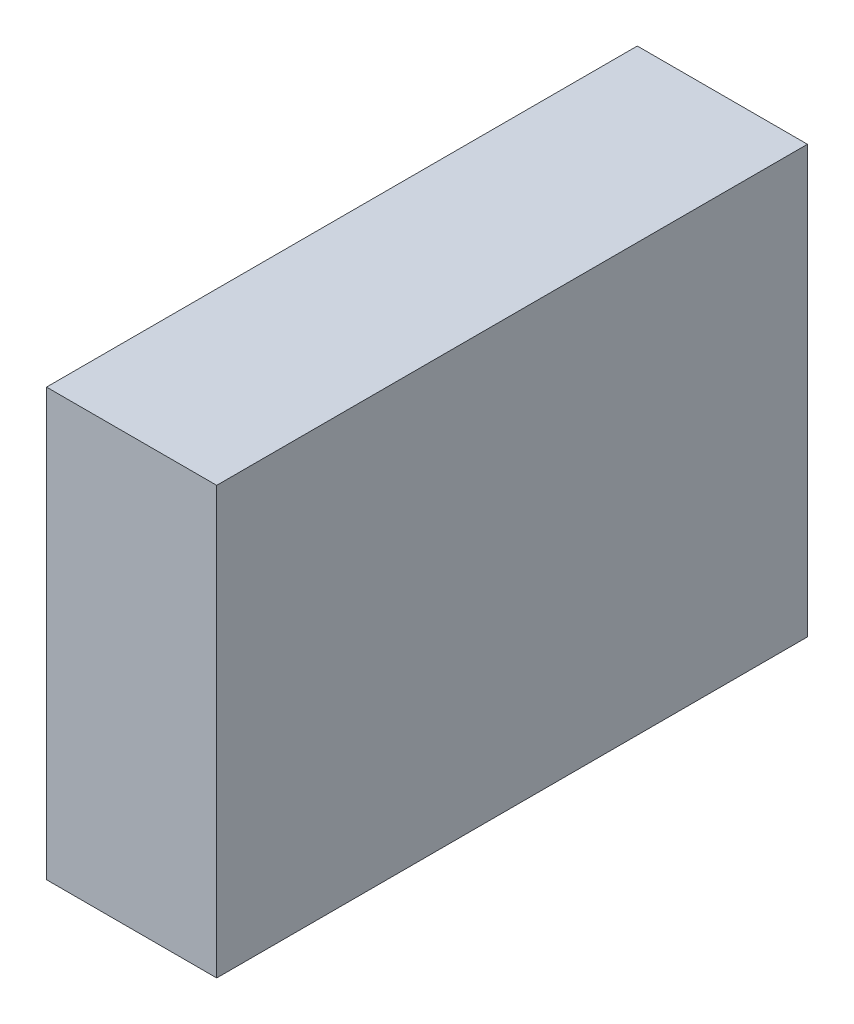
ISO-10303-21;
HEADER;
FILE_DESCRIPTION(('STEP AP214'),'2;1');
FILE_NAME('part.step','',(''),(''),'','','');
FILE_SCHEMA(('AUTOMOTIVE_DESIGN { 1 0 10303 214 1 1 1 1 }'));
ENDSEC;
DATA;
#1=APPLICATION_CONTEXT('core data for automotive mechanical design processes');
#2=APPLICATION_PROTOCOL_DEFINITION('international standard','automotive_design',2000,#1);
#3=PRODUCT_CONTEXT('',#1,'mechanical');
#4=PRODUCT('Part','Part','',(#3));
#5=PRODUCT_RELATED_PRODUCT_CATEGORY('part','',(#4));
#6=PRODUCT_DEFINITION_FORMATION('','',#4);
#7=PRODUCT_DEFINITION_CONTEXT('part definition',#1,'design');
#8=PRODUCT_DEFINITION('design','',#6,#7);
#9=PRODUCT_DEFINITION_SHAPE('','',#8);
#10=(LENGTH_UNIT() NAMED_UNIT(*) SI_UNIT(.MILLI.,.METRE.));
#11=(NAMED_UNIT(*) PLANE_ANGLE_UNIT() SI_UNIT($,.RADIAN.));
#12=(NAMED_UNIT(*) SI_UNIT($,.STERADIAN.) SOLID_ANGLE_UNIT());
#13=UNCERTAINTY_MEASURE_WITH_UNIT(LENGTH_MEASURE(1.E-05),#10,'distance_accuracy_value','');
#14=(GEOMETRIC_REPRESENTATION_CONTEXT(3) GLOBAL_UNCERTAINTY_ASSIGNED_CONTEXT((#13)) GLOBAL_UNIT_ASSIGNED_CONTEXT((#10,
#11,#12)) REPRESENTATION_CONTEXT('',''));
#15=CARTESIAN_POINT('',(0.,0.,0.));
#16=DIRECTION('',(0.,0.,1.));
#17=DIRECTION('',(1.,0.,0.));
#18=AXIS2_PLACEMENT_3D('',#15,#16,#17);
#19=CARTESIAN_POINT('',(0.,0.,914.4));
#20=DIRECTION('',(1.,0.,0.));
#21=DIRECTION('',(0.,0.,-1.));
#22=AXIS2_PLACEMENT_3D('',#19,#20,#21);
#23=PLANE('',#22);
#24=DIRECTION('',(0.,-1.,0.));
#25=VECTOR('',#24,1.);
#26=CARTESIAN_POINT('',(0.,0.,0.));
#27=LINE('',#26,#25);
#28=CARTESIAN_POINT('',(0.,660.4,0.));
#29=VERTEX_POINT('',#28);
#30=CARTESIAN_POINT('',(0.,0.,0.));
#31=VERTEX_POINT('',#30);
#32=EDGE_CURVE('E113',#29,#31,#27,.T.);
#33=ORIENTED_EDGE('',*,*,#32,.T.);
#34=DIRECTION('',(0.,0.,-1.));
#35=VECTOR('',#34,1.);
#36=CARTESIAN_POINT('',(0.,0.,914.4));
#37=LINE('',#36,#35);
#38=CARTESIAN_POINT('',(0.,0.,914.4));
#39=VERTEX_POINT('',#38);
#40=EDGE_CURVE('E11',#39,#31,#37,.T.);
#41=ORIENTED_EDGE('',*,*,#40,.F.);
#42=DIRECTION('',(0.,-1.,0.));
#43=VECTOR('',#42,1.);
#44=CARTESIAN_POINT('',(0.,0.,914.4));
#45=LINE('',#44,#43);
#46=CARTESIAN_POINT('',(0.,660.4,914.4));
#47=VERTEX_POINT('',#46);
#48=EDGE_CURVE('E97',#47,#39,#45,.T.);
#49=ORIENTED_EDGE('',*,*,#48,.F.);
#50=DIRECTION('',(0.,0.,-1.));
#51=VECTOR('',#50,1.);
#52=CARTESIAN_POINT('',(0.,660.4,914.4));
#53=LINE('',#52,#51);
#54=EDGE_CURVE('E109',#47,#29,#53,.T.);
#55=ORIENTED_EDGE('',*,*,#54,.T.);
#56=EDGE_LOOP('',(#33,#41,#49,#55));
#57=FACE_BOUND('',#56,.T.);
#58=ADVANCED_FACE('F45',(#57),#23,.F.);
#59=CARTESIAN_POINT('',(0.,0.,914.4));
#60=DIRECTION('',(0.,1.,0.));
#61=DIRECTION('',(0.,0.,1.));
#62=AXIS2_PLACEMENT_3D('',#59,#60,#61);
#63=PLANE('',#62);
#64=DIRECTION('',(1.,0.,0.));
#65=VECTOR('',#64,1.);
#66=CARTESIAN_POINT('',(0.,0.,0.));
#67=LINE('',#66,#65);
#68=CARTESIAN_POINT('',(263.398,0.,0.));
#69=VERTEX_POINT('',#68);
#70=EDGE_CURVE('E102',#31,#69,#67,.T.);
#71=ORIENTED_EDGE('',*,*,#70,.T.);
#72=DIRECTION('',(0.,0.,-1.));
#73=VECTOR('',#72,1.);
#74=CARTESIAN_POINT('',(263.398,0.,914.4));
#75=LINE('',#74,#73);
#76=CARTESIAN_POINT('',(263.398,0.,914.4));
#77=VERTEX_POINT('',#76);
#78=EDGE_CURVE('E54',#77,#69,#75,.T.);
#79=ORIENTED_EDGE('',*,*,#78,.F.);
#80=DIRECTION('',(1.,0.,0.));
#81=VECTOR('',#80,1.);
#82=CARTESIAN_POINT('',(0.,0.,914.4));
#83=LINE('',#82,#81);
#84=EDGE_CURVE('E92',#39,#77,#83,.T.);
#85=ORIENTED_EDGE('',*,*,#84,.F.);
#86=ORIENTED_EDGE('',*,*,#40,.T.);
#87=EDGE_LOOP('',(#71,#79,#85,#86));
#88=FACE_BOUND('',#87,.T.);
#89=ADVANCED_FACE('F101',(#88),#63,.F.);
#90=CARTESIAN_POINT('',(263.398,0.,914.4));
#91=DIRECTION('',(-1.,0.,0.));
#92=DIRECTION('',(0.,0.,1.));
#93=AXIS2_PLACEMENT_3D('',#90,#91,#92);
#94=PLANE('',#93);
#95=DIRECTION('',(0.,1.,0.));
#96=VECTOR('',#95,1.);
#97=CARTESIAN_POINT('',(263.398,0.,0.));
#98=LINE('',#97,#96);
#99=CARTESIAN_POINT('',(263.398,660.4,0.));
#100=VERTEX_POINT('',#99);
#101=EDGE_CURVE('E79',#69,#100,#98,.T.);
#102=ORIENTED_EDGE('',*,*,#101,.T.);
#103=DIRECTION('',(0.,0.,-1.));
#104=VECTOR('',#103,1.);
#105=CARTESIAN_POINT('',(263.398,660.4,914.4));
#106=LINE('',#105,#104);
#107=CARTESIAN_POINT('',(263.398,660.4,914.4));
#108=VERTEX_POINT('',#107);
#109=EDGE_CURVE('E104',#108,#100,#106,.T.);
#110=ORIENTED_EDGE('',*,*,#109,.F.);
#111=DIRECTION('',(0.,1.,0.));
#112=VECTOR('',#111,1.);
#113=CARTESIAN_POINT('',(263.398,0.,914.4));
#114=LINE('',#113,#112);
#115=EDGE_CURVE('E95',#77,#108,#114,.T.);
#116=ORIENTED_EDGE('',*,*,#115,.F.);
#117=ORIENTED_EDGE('',*,*,#78,.T.);
#118=EDGE_LOOP('',(#102,#110,#116,#117));
#119=FACE_BOUND('',#118,.T.);
#120=ADVANCED_FACE('F105',(#119),#94,.F.);
#121=CARTESIAN_POINT('',(0.,660.4,914.4));
#122=DIRECTION('',(0.,-1.,0.));
#123=DIRECTION('',(0.,0.,-1.));
#124=AXIS2_PLACEMENT_3D('',#121,#122,#123);
#125=PLANE('',#124);
#126=DIRECTION('',(-1.,0.,0.));
#127=VECTOR('',#126,1.);
#128=CARTESIAN_POINT('',(0.,660.4,0.));
#129=LINE('',#128,#127);
#130=EDGE_CURVE('E85',#100,#29,#129,.T.);
#131=ORIENTED_EDGE('',*,*,#130,.T.);
#132=ORIENTED_EDGE('',*,*,#54,.F.);
#133=DIRECTION('',(-1.,0.,0.));
#134=VECTOR('',#133,1.);
#135=CARTESIAN_POINT('',(0.,660.4,914.4));
#136=LINE('',#135,#134);
#137=EDGE_CURVE('E62',#108,#47,#136,.T.);
#138=ORIENTED_EDGE('',*,*,#137,.F.);
#139=ORIENTED_EDGE('',*,*,#109,.T.);
#140=EDGE_LOOP('',(#131,#132,#138,#139));
#141=FACE_BOUND('',#140,.T.);
#142=ADVANCED_FACE('F126',(#141),#125,.F.);
#143=CARTESIAN_POINT('',(0.,0.,914.4));
#144=DIRECTION('',(0.,0.,-1.));
#145=DIRECTION('',(-1.,0.,0.));
#146=AXIS2_PLACEMENT_3D('',#143,#144,#145);
#147=PLANE('',#146);
#148=ORIENTED_EDGE('',*,*,#48,.T.);
#149=ORIENTED_EDGE('',*,*,#84,.T.);
#150=ORIENTED_EDGE('',*,*,#115,.T.);
#151=ORIENTED_EDGE('',*,*,#137,.T.);
#152=EDGE_LOOP('',(#148,#149,#150,#151));
#153=FACE_BOUND('',#152,.T.);
#154=ADVANCED_FACE('F93',(#153),#147,.F.);
#155=CARTESIAN_POINT('',(0.,0.,0.));
#156=DIRECTION('',(0.,0.,-1.));
#157=DIRECTION('',(-1.,0.,0.));
#158=AXIS2_PLACEMENT_3D('',#155,#156,#157);
#159=PLANE('',#158);
#160=ORIENTED_EDGE('',*,*,#32,.F.);
#161=ORIENTED_EDGE('',*,*,#130,.F.);
#162=ORIENTED_EDGE('',*,*,#101,.F.);
#163=ORIENTED_EDGE('',*,*,#70,.F.);
#164=EDGE_LOOP('',(#160,#161,#162,#163));
#165=FACE_BOUND('',#164,.T.);
#166=ADVANCED_FACE('F129',(#165),#159,.T.);
#167=CLOSED_SHELL('',(#58,#89,#120,#142,#154,#166));
#168=MANIFOLD_SOLID_BREP('B2',#167);
#169=ADVANCED_BREP_SHAPE_REPRESENTATION('',(#18,#168),#14);
#170=SHAPE_DEFINITION_REPRESENTATION(#9,#169);
ENDSEC;
END-ISO-10303-21;
